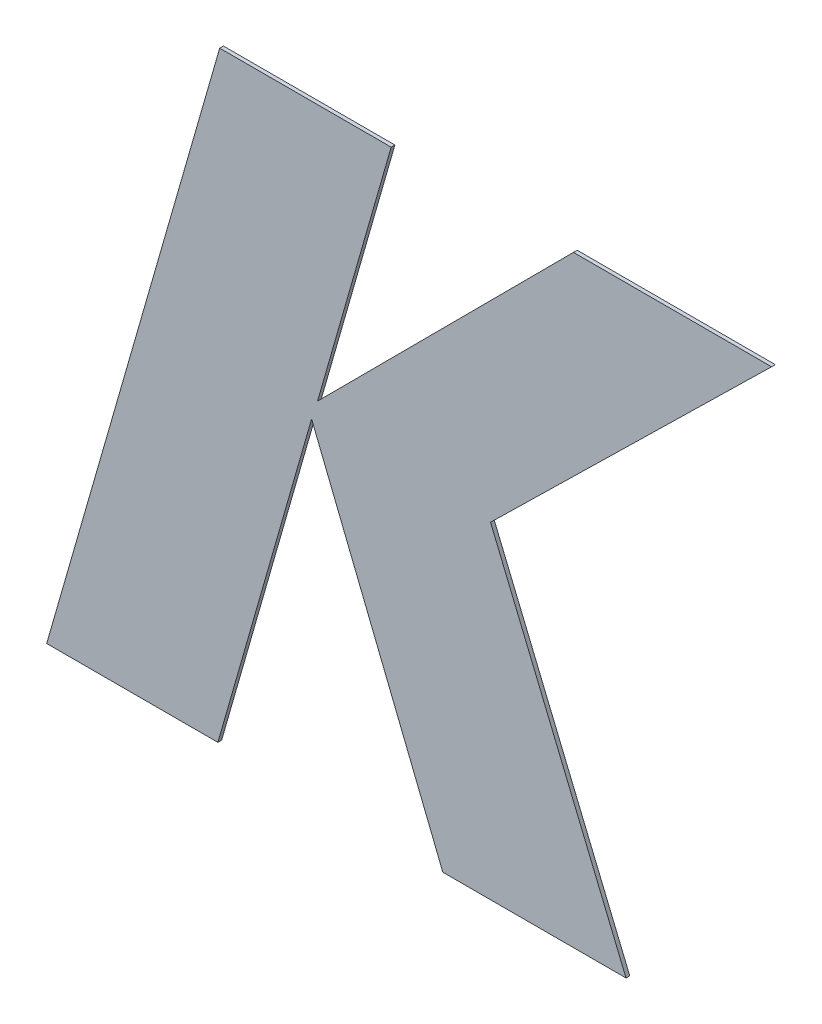
ISO-10303-21;
HEADER;
FILE_DESCRIPTION(('STEP AP214'),'2;1');
FILE_NAME('part.step','',(''),(''),'','','');
FILE_SCHEMA(('AUTOMOTIVE_DESIGN { 1 0 10303 214 1 1 1 1 }'));
ENDSEC;
DATA;
#1=APPLICATION_CONTEXT('core data for automotive mechanical design processes');
#2=APPLICATION_PROTOCOL_DEFINITION('international standard','automotive_design',2000,#1);
#3=PRODUCT_CONTEXT('',#1,'mechanical');
#4=PRODUCT('Part','Part','',(#3));
#5=PRODUCT_RELATED_PRODUCT_CATEGORY('part','',(#4));
#6=PRODUCT_DEFINITION_FORMATION('','',#4);
#7=PRODUCT_DEFINITION_CONTEXT('part definition',#1,'design');
#8=PRODUCT_DEFINITION('design','',#6,#7);
#9=PRODUCT_DEFINITION_SHAPE('','',#8);
#10=(LENGTH_UNIT() NAMED_UNIT(*) SI_UNIT(.MILLI.,.METRE.));
#11=(NAMED_UNIT(*) PLANE_ANGLE_UNIT() SI_UNIT($,.RADIAN.));
#12=(NAMED_UNIT(*) SI_UNIT($,.STERADIAN.) SOLID_ANGLE_UNIT());
#13=UNCERTAINTY_MEASURE_WITH_UNIT(LENGTH_MEASURE(1.E-05),#10,'distance_accuracy_value','');
#14=(GEOMETRIC_REPRESENTATION_CONTEXT(3) GLOBAL_UNCERTAINTY_ASSIGNED_CONTEXT((#13)) GLOBAL_UNIT_ASSIGNED_CONTEXT((#10,
#11,#12)) REPRESENTATION_CONTEXT('',''));
#15=CARTESIAN_POINT('',(0.,0.,0.));
#16=DIRECTION('',(0.,0.,1.));
#17=DIRECTION('',(1.,0.,0.));
#18=AXIS2_PLACEMENT_3D('',#15,#16,#17);
#19=CARTESIAN_POINT('',(1.54152,2.79695,2.505));
#20=DIRECTION('',(0.961099233431586,-0.276203301025201,0.));
#21=DIRECTION('',(0.,0.,-1.));
#22=AXIS2_PLACEMENT_3D('',#19,#20,#21);
#23=PLANE('',#22);
#24=DIRECTION('',(-0.276203301025201,-0.961099233431586,0.));
#25=VECTOR('',#24,1.);
#26=CARTESIAN_POINT('',(1.54152,2.79695,2.5));
#27=LINE('',#26,#25);
#28=CARTESIAN_POINT('',(1.77328279920816,3.60341048700408,2.5));
#29=VERTEX_POINT('',#28);
#30=CARTESIAN_POINT('',(1.54152,2.79695,2.5));
#31=VERTEX_POINT('',#30);
#32=EDGE_CURVE('E10',#29,#31,#27,.T.);
#33=ORIENTED_EDGE('',*,*,#32,.T.);
#34=DIRECTION('',(0.,0.,-1.));
#35=VECTOR('',#34,1.);
#36=CARTESIAN_POINT('',(1.54152,2.79695,2.505));
#37=LINE('',#36,#35);
#38=CARTESIAN_POINT('',(1.54152,2.79695,2.505));
#39=VERTEX_POINT('',#38);
#40=EDGE_CURVE('E42',#39,#31,#37,.T.);
#41=ORIENTED_EDGE('',*,*,#40,.F.);
#42=DIRECTION('',(-0.276203301025201,-0.961099233431586,0.));
#43=VECTOR('',#42,1.);
#44=CARTESIAN_POINT('',(1.54152,2.79695,2.505));
#45=LINE('',#44,#43);
#46=CARTESIAN_POINT('',(1.77328279920816,3.60341048700408,2.505));
#47=VERTEX_POINT('',#46);
#48=EDGE_CURVE('E131',#47,#39,#45,.T.);
#49=ORIENTED_EDGE('',*,*,#48,.F.);
#50=DIRECTION('',(0.,0.,-1.));
#51=VECTOR('',#50,1.);
#52=CARTESIAN_POINT('',(1.77328279920816,3.60341048700408,2.505));
#53=LINE('',#52,#51);
#54=EDGE_CURVE('E27',#47,#29,#53,.T.);
#55=ORIENTED_EDGE('',*,*,#54,.T.);
#56=EDGE_LOOP('',(#33,#41,#49,#55));
#57=FACE_BOUND('',#56,.T.);
#58=ADVANCED_FACE('F16',(#57),#23,.F.);
#59=CARTESIAN_POINT('',(1.77084047990213,2.79695,2.505));
#60=DIRECTION('',(0.,1.,0.));
#61=DIRECTION('',(1.,0.,-1.10443527591038E-13));
#62=AXIS2_PLACEMENT_3D('',#59,#60,#61);
#63=PLANE('',#62);
#64=DIRECTION('',(1.,-1.10443527591038E-13,0.));
#65=VECTOR('',#64,1.);
#66=CARTESIAN_POINT('',(1.77084047990213,2.79695,2.5));
#67=LINE('',#66,#65);
#68=CARTESIAN_POINT('',(1.77084047990213,2.79695,2.5));
#69=VERTEX_POINT('',#68);
#70=EDGE_CURVE('E137',#31,#69,#67,.T.);
#71=ORIENTED_EDGE('',*,*,#70,.T.);
#72=DIRECTION('',(0.,0.,-1.));
#73=VECTOR('',#72,1.);
#74=CARTESIAN_POINT('',(1.77084047990213,2.79695,2.505));
#75=LINE('',#74,#73);
#76=CARTESIAN_POINT('',(1.77084047990213,2.79695,2.505));
#77=VERTEX_POINT('',#76);
#78=EDGE_CURVE('E134',#77,#69,#75,.T.);
#79=ORIENTED_EDGE('',*,*,#78,.F.);
#80=DIRECTION('',(1.,-1.10443527591038E-13,0.));
#81=VECTOR('',#80,1.);
#82=CARTESIAN_POINT('',(1.77084047990213,2.79695,2.505));
#83=LINE('',#82,#81);
#84=EDGE_CURVE('E125',#39,#77,#83,.T.);
#85=ORIENTED_EDGE('',*,*,#84,.F.);
#86=ORIENTED_EDGE('',*,*,#40,.T.);
#87=EDGE_LOOP('',(#71,#79,#85,#86));
#88=FACE_BOUND('',#87,.T.);
#89=ADVANCED_FACE('F135',(#88),#63,.F.);
#90=CARTESIAN_POINT('',(1.89634770470114,3.23483615675617,2.505));
#91=DIRECTION('',(-0.961293454474758,0.275526576547503,0.));
#92=DIRECTION('',(0.,0.,1.));
#93=AXIS2_PLACEMENT_3D('',#90,#91,#92);
#94=PLANE('',#93);
#95=DIRECTION('',(0.275526576547503,0.961293454474758,0.));
#96=VECTOR('',#95,1.);
#97=CARTESIAN_POINT('',(1.89634770470114,3.23483615675617,2.5));
#98=LINE('',#97,#96);
#99=CARTESIAN_POINT('',(1.89634770470114,3.23483615675617,2.5));
#100=VERTEX_POINT('',#99);
#101=EDGE_CURVE('E142',#69,#100,#98,.T.);
#102=ORIENTED_EDGE('',*,*,#101,.T.);
#103=DIRECTION('',(0.,0.,-1.));
#104=VECTOR('',#103,1.);
#105=CARTESIAN_POINT('',(1.89634770470114,3.23483615675617,2.505));
#106=LINE('',#105,#104);
#107=CARTESIAN_POINT('',(1.89634770470114,3.23483615675617,2.505));
#108=VERTEX_POINT('',#107);
#109=EDGE_CURVE('E146',#108,#100,#106,.T.);
#110=ORIENTED_EDGE('',*,*,#109,.F.);
#111=DIRECTION('',(0.275526576547503,0.961293454474758,0.));
#112=VECTOR('',#111,1.);
#113=CARTESIAN_POINT('',(1.89634770470114,3.23483615675617,2.505));
#114=LINE('',#113,#112);
#115=EDGE_CURVE('E129',#77,#108,#114,.T.);
#116=ORIENTED_EDGE('',*,*,#115,.F.);
#117=ORIENTED_EDGE('',*,*,#78,.T.);
#118=EDGE_LOOP('',(#102,#110,#116,#117));
#119=FACE_BOUND('',#118,.T.);
#120=ADVANCED_FACE('F145',(#119),#94,.F.);
#121=CARTESIAN_POINT('',(2.07211372791904,2.79695,2.505));
#122=DIRECTION('',(0.928029086213704,0.372507738364397,0.));
#123=DIRECTION('',(0.,0.,-1.));
#124=AXIS2_PLACEMENT_3D('',#121,#122,#123);
#125=PLANE('',#124);
#126=DIRECTION('',(0.372507738364397,-0.928029086213704,0.));
#127=VECTOR('',#126,1.);
#128=CARTESIAN_POINT('',(2.07211372791904,2.79695,2.5));
#129=LINE('',#128,#127);
#130=CARTESIAN_POINT('',(2.07211372791904,2.79695,2.5));
#131=VERTEX_POINT('',#130);
#132=EDGE_CURVE('E143',#100,#131,#129,.T.);
#133=ORIENTED_EDGE('',*,*,#132,.T.);
#134=DIRECTION('',(0.,0.,-1.));
#135=VECTOR('',#134,1.);
#136=CARTESIAN_POINT('',(2.07211372791904,2.79695,2.505));
#137=LINE('',#136,#135);
#138=CARTESIAN_POINT('',(2.07211372791904,2.79695,2.505));
#139=VERTEX_POINT('',#138);
#140=EDGE_CURVE('E165',#139,#131,#137,.T.);
#141=ORIENTED_EDGE('',*,*,#140,.F.);
#142=DIRECTION('',(0.372507738364397,-0.928029086213704,0.));
#143=VECTOR('',#142,1.);
#144=CARTESIAN_POINT('',(2.07211372791904,2.79695,2.505));
#145=LINE('',#144,#143);
#146=EDGE_CURVE('E149',#108,#139,#145,.T.);
#147=ORIENTED_EDGE('',*,*,#146,.F.);
#148=ORIENTED_EDGE('',*,*,#109,.T.);
#149=EDGE_LOOP('',(#133,#141,#147,#148));
#150=FACE_BOUND('',#149,.T.);
#151=ADVANCED_FACE('F308',(#150),#125,.F.);
#152=CARTESIAN_POINT('',(2.31749318928673,2.79695,2.505));
#153=DIRECTION('',(0.,1.,0.));
#154=DIRECTION('',(1.,0.,0.));
#155=AXIS2_PLACEMENT_3D('',#152,#153,#154);
#156=PLANE('',#155);
#157=DIRECTION('',(1.,0.,0.));
#158=VECTOR('',#157,1.);
#159=CARTESIAN_POINT('',(2.31749318928673,2.79695,2.5));
#160=LINE('',#159,#158);
#161=CARTESIAN_POINT('',(2.31749318928673,2.79695,2.5));
#162=VERTEX_POINT('',#161);
#163=EDGE_CURVE('E210',#131,#162,#160,.T.);
#164=ORIENTED_EDGE('',*,*,#163,.T.);
#165=DIRECTION('',(0.,0.,-1.));
#166=VECTOR('',#165,1.);
#167=CARTESIAN_POINT('',(2.31749318928673,2.79695,2.505));
#168=LINE('',#167,#166);
#169=CARTESIAN_POINT('',(2.31749318928673,2.79695,2.505));
#170=VERTEX_POINT('',#169);
#171=EDGE_CURVE('E166',#170,#162,#168,.T.);
#172=ORIENTED_EDGE('',*,*,#171,.F.);
#173=DIRECTION('',(1.,0.,0.));
#174=VECTOR('',#173,1.);
#175=CARTESIAN_POINT('',(2.31749318928673,2.79695,2.505));
#176=LINE('',#175,#174);
#177=EDGE_CURVE('E155',#139,#170,#176,.T.);
#178=ORIENTED_EDGE('',*,*,#177,.F.);
#179=ORIENTED_EDGE('',*,*,#140,.T.);
#180=EDGE_LOOP('',(#164,#172,#178,#179));
#181=FACE_BOUND('',#180,.T.);
#182=ADVANCED_FACE('F346',(#181),#156,.F.);
#183=CARTESIAN_POINT('',(2.1359867363703,3.23483615675617,2.505));
#184=DIRECTION('',(-0.923783981403877,-0.382914031737676,0.));
#185=DIRECTION('',(-0.382914031737676,0.923783981403877,0.));
#186=AXIS2_PLACEMENT_3D('',#183,#184,#185);
#187=PLANE('',#186);
#188=DIRECTION('',(-0.382914031737676,0.923783981403877,0.));
#189=VECTOR('',#188,1.);
#190=CARTESIAN_POINT('',(2.1359867363703,3.23483615675617,2.5));
#191=LINE('',#190,#189);
#192=CARTESIAN_POINT('',(2.1359867363703,3.23483615675617,2.5));
#193=VERTEX_POINT('',#192);
#194=EDGE_CURVE('E161',#162,#193,#191,.T.);
#195=ORIENTED_EDGE('',*,*,#194,.T.);
#196=DIRECTION('',(0.,0.,-1.));
#197=VECTOR('',#196,1.);
#198=CARTESIAN_POINT('',(2.1359867363703,3.23483615675617,2.505));
#199=LINE('',#198,#197);
#200=CARTESIAN_POINT('',(2.1359867363703,3.23483615675617,2.505));
#201=VERTEX_POINT('',#200);
#202=EDGE_CURVE('E197',#201,#193,#199,.T.);
#203=ORIENTED_EDGE('',*,*,#202,.F.);
#204=DIRECTION('',(-0.382914031737676,0.923783981403877,0.));
#205=VECTOR('',#204,1.);
#206=CARTESIAN_POINT('',(2.1359867363703,3.23483615675617,2.505));
#207=LINE('',#206,#205);
#208=EDGE_CURVE('E158',#170,#201,#207,.T.);
#209=ORIENTED_EDGE('',*,*,#208,.F.);
#210=ORIENTED_EDGE('',*,*,#171,.T.);
#211=EDGE_LOOP('',(#195,#203,#209,#210));
#212=FACE_BOUND('',#211,.T.);
#213=ADVANCED_FACE('F246',(#212),#187,.F.);
#214=CARTESIAN_POINT('',(2.51246672525286,3.60341048700408,2.505));
#215=DIRECTION('',(-0.699564397226959,0.714569558638263,0.));
#216=DIRECTION('',(0.,0.,1.));
#217=AXIS2_PLACEMENT_3D('',#214,#215,#216);
#218=PLANE('',#217);
#219=DIRECTION('',(0.714569558638262,0.699564397226959,0.));
#220=VECTOR('',#219,1.);
#221=CARTESIAN_POINT('',(2.51246672525286,3.60341048700408,2.5));
#222=LINE('',#221,#220);
#223=CARTESIAN_POINT('',(2.51246672525286,3.60341048700408,2.5));
#224=VERTEX_POINT('',#223);
#225=EDGE_CURVE('E201',#193,#224,#222,.T.);
#226=ORIENTED_EDGE('',*,*,#225,.T.);
#227=DIRECTION('',(0.,0.,-1.));
#228=VECTOR('',#227,1.);
#229=CARTESIAN_POINT('',(2.51246672525286,3.60341048700408,2.505));
#230=LINE('',#229,#228);
#231=CARTESIAN_POINT('',(2.51246672525286,3.60341048700408,2.505));
#232=VERTEX_POINT('',#231);
#233=EDGE_CURVE('E198',#232,#224,#230,.T.);
#234=ORIENTED_EDGE('',*,*,#233,.F.);
#235=DIRECTION('',(0.714569558638262,0.699564397226959,0.));
#236=VECTOR('',#235,1.);
#237=CARTESIAN_POINT('',(2.51246672525286,3.60341048700408,2.505));
#238=LINE('',#237,#236);
#239=EDGE_CURVE('E182',#201,#232,#238,.T.);
#240=ORIENTED_EDGE('',*,*,#239,.F.);
#241=ORIENTED_EDGE('',*,*,#202,.T.);
#242=EDGE_LOOP('',(#226,#234,#240,#241));
#243=FACE_BOUND('',#242,.T.);
#244=ADVANCED_FACE('F18',(#243),#218,.F.);
#245=CARTESIAN_POINT('',(2.24706809769219,3.60341048700408,2.505));
#246=DIRECTION('',(0.,-1.,0.));
#247=DIRECTION('',(0.,0.,-1.));
#248=AXIS2_PLACEMENT_3D('',#245,#246,#247);
#249=PLANE('',#248);
#250=DIRECTION('',(-1.,0.,0.));
#251=VECTOR('',#250,1.);
#252=CARTESIAN_POINT('',(2.24706809769219,3.60341048700408,2.5));
#253=LINE('',#252,#251);
#254=CARTESIAN_POINT('',(2.24706809769219,3.60341048700408,2.5));
#255=VERTEX_POINT('',#254);
#256=EDGE_CURVE('E193',#224,#255,#253,.T.);
#257=ORIENTED_EDGE('',*,*,#256,.T.);
#258=DIRECTION('',(0.,0.,-1.));
#259=VECTOR('',#258,1.);
#260=CARTESIAN_POINT('',(2.24706809769219,3.60341048700408,2.505));
#261=LINE('',#260,#259);
#262=CARTESIAN_POINT('',(2.24706809769219,3.60341048700408,2.505));
#263=VERTEX_POINT('',#262);
#264=EDGE_CURVE('E180',#263,#255,#261,.T.);
#265=ORIENTED_EDGE('',*,*,#264,.F.);
#266=DIRECTION('',(-1.,0.,0.));
#267=VECTOR('',#266,1.);
#268=CARTESIAN_POINT('',(2.24706809769219,3.60341048700408,2.505));
#269=LINE('',#268,#267);
#270=EDGE_CURVE('E20',#232,#263,#269,.T.);
#271=ORIENTED_EDGE('',*,*,#270,.F.);
#272=ORIENTED_EDGE('',*,*,#233,.T.);
#273=EDGE_LOOP('',(#257,#265,#271,#272));
#274=FACE_BOUND('',#273,.T.);
#275=ADVANCED_FACE('F257',(#274),#249,.F.);
#276=CARTESIAN_POINT('',(1.90432937927588,3.25950455606161,2.505));
#277=DIRECTION('',(0.708307753494397,-0.70590376563645,0.));
#278=DIRECTION('',(0.,0.,-1.));
#279=AXIS2_PLACEMENT_3D('',#276,#277,#278);
#280=PLANE('',#279);
#281=DIRECTION('',(-0.70590376563645,-0.708307753494397,0.));
#282=VECTOR('',#281,1.);
#283=CARTESIAN_POINT('',(1.90432937927588,3.25950455606161,2.5));
#284=LINE('',#283,#282);
#285=CARTESIAN_POINT('',(1.90432937927588,3.25950455606161,2.5));
#286=VERTEX_POINT('',#285);
#287=EDGE_CURVE('E205',#255,#286,#284,.T.);
#288=ORIENTED_EDGE('',*,*,#287,.T.);
#289=DIRECTION('',(0.,0.,-1.));
#290=VECTOR('',#289,1.);
#291=CARTESIAN_POINT('',(1.90432937927588,3.25950455606161,2.505));
#292=LINE('',#291,#290);
#293=CARTESIAN_POINT('',(1.90432937927588,3.25950455606161,2.505));
#294=VERTEX_POINT('',#293);
#295=EDGE_CURVE('E181',#294,#286,#292,.T.);
#296=ORIENTED_EDGE('',*,*,#295,.F.);
#297=DIRECTION('',(-0.70590376563645,-0.708307753494397,0.));
#298=VECTOR('',#297,1.);
#299=CARTESIAN_POINT('',(1.90432937927588,3.25950455606161,2.505));
#300=LINE('',#299,#298);
#301=EDGE_CURVE('E221',#263,#294,#300,.T.);
#302=ORIENTED_EDGE('',*,*,#301,.F.);
#303=ORIENTED_EDGE('',*,*,#264,.T.);
#304=EDGE_LOOP('',(#288,#296,#302,#303));
#305=FACE_BOUND('',#304,.T.);
#306=ADVANCED_FACE('F320',(#305),#280,.F.);
#307=CARTESIAN_POINT('',(2.00290979565373,3.60341048700408,2.505));
#308=DIRECTION('',(-0.961286149092731,0.27555206325206,0.));
#309=DIRECTION('',(0.,0.,1.));
#310=AXIS2_PLACEMENT_3D('',#307,#308,#309);
#311=PLANE('',#310);
#312=DIRECTION('',(0.27555206325206,0.961286149092731,0.));
#313=VECTOR('',#312,1.);
#314=CARTESIAN_POINT('',(2.00290979565373,3.60341048700408,2.5));
#315=LINE('',#314,#313);
#316=CARTESIAN_POINT('',(2.00290979565373,3.60341048700408,2.5));
#317=VERTEX_POINT('',#316);
#318=EDGE_CURVE('E177',#286,#317,#315,.T.);
#319=ORIENTED_EDGE('',*,*,#318,.T.);
#320=DIRECTION('',(0.,0.,-1.));
#321=VECTOR('',#320,1.);
#322=CARTESIAN_POINT('',(2.00290979565373,3.60341048700408,2.505));
#323=LINE('',#322,#321);
#324=CARTESIAN_POINT('',(2.00290979565373,3.60341048700408,2.505));
#325=VERTEX_POINT('',#324);
#326=EDGE_CURVE('E98',#325,#317,#323,.T.);
#327=ORIENTED_EDGE('',*,*,#326,.F.);
#328=DIRECTION('',(0.27555206325206,0.961286149092731,0.));
#329=VECTOR('',#328,1.);
#330=CARTESIAN_POINT('',(2.00290979565373,3.60341048700408,2.505));
#331=LINE('',#330,#329);
#332=EDGE_CURVE('E112',#294,#325,#331,.T.);
#333=ORIENTED_EDGE('',*,*,#332,.F.);
#334=ORIENTED_EDGE('',*,*,#295,.T.);
#335=EDGE_LOOP('',(#319,#327,#333,#334));
#336=FACE_BOUND('',#335,.T.);
#337=ADVANCED_FACE('F334',(#336),#311,.F.);
#338=CARTESIAN_POINT('',(1.77328279920816,3.60341048700408,2.505));
#339=DIRECTION('',(0.,-1.,0.));
#340=DIRECTION('',(0.,0.,-1.));
#341=AXIS2_PLACEMENT_3D('',#338,#339,#340);
#342=PLANE('',#341);
#343=DIRECTION('',(-1.,0.,0.));
#344=VECTOR('',#343,1.);
#345=CARTESIAN_POINT('',(1.77328279920816,3.60341048700408,2.5));
#346=LINE('',#345,#344);
#347=EDGE_CURVE('E188',#317,#29,#346,.T.);
#348=ORIENTED_EDGE('',*,*,#347,.T.);
#349=ORIENTED_EDGE('',*,*,#54,.F.);
#350=DIRECTION('',(-1.,0.,0.));
#351=VECTOR('',#350,1.);
#352=CARTESIAN_POINT('',(1.77328279920816,3.60341048700408,2.505));
#353=LINE('',#352,#351);
#354=EDGE_CURVE('E174',#325,#47,#353,.T.);
#355=ORIENTED_EDGE('',*,*,#354,.F.);
#356=ORIENTED_EDGE('',*,*,#326,.T.);
#357=EDGE_LOOP('',(#348,#349,#355,#356));
#358=FACE_BOUND('',#357,.T.);
#359=ADVANCED_FACE('F329',(#358),#342,.F.);
#360=CARTESIAN_POINT('',(-0.0875343276926901,0.18669957358834,2.505));
#361=DIRECTION('',(0.,0.,-1.));
#362=DIRECTION('',(0.,-1.,0.));
#363=AXIS2_PLACEMENT_3D('',#360,#361,#362);
#364=PLANE('',#363);
#365=ORIENTED_EDGE('',*,*,#48,.T.);
#366=ORIENTED_EDGE('',*,*,#84,.T.);
#367=ORIENTED_EDGE('',*,*,#115,.T.);
#368=ORIENTED_EDGE('',*,*,#146,.T.);
#369=ORIENTED_EDGE('',*,*,#177,.T.);
#370=ORIENTED_EDGE('',*,*,#208,.T.);
#371=ORIENTED_EDGE('',*,*,#239,.T.);
#372=ORIENTED_EDGE('',*,*,#270,.T.);
#373=ORIENTED_EDGE('',*,*,#301,.T.);
#374=ORIENTED_EDGE('',*,*,#332,.T.);
#375=ORIENTED_EDGE('',*,*,#354,.T.);
#376=EDGE_LOOP('',(#365,#366,#367,#368,#369,#370,#371,#372,#373,#374,#375));
#377=FACE_BOUND('',#376,.T.);
#378=ADVANCED_FACE('F127',(#377),#364,.F.);
#379=CARTESIAN_POINT('',(-0.0875343276926901,0.18669957358834,2.5));
#380=DIRECTION('',(0.,0.,-1.));
#381=DIRECTION('',(0.,-1.,0.));
#382=AXIS2_PLACEMENT_3D('',#379,#380,#381);
#383=PLANE('',#382);
#384=ORIENTED_EDGE('',*,*,#32,.F.);
#385=ORIENTED_EDGE('',*,*,#347,.F.);
#386=ORIENTED_EDGE('',*,*,#318,.F.);
#387=ORIENTED_EDGE('',*,*,#287,.F.);
#388=ORIENTED_EDGE('',*,*,#256,.F.);
#389=ORIENTED_EDGE('',*,*,#225,.F.);
#390=ORIENTED_EDGE('',*,*,#194,.F.);
#391=ORIENTED_EDGE('',*,*,#163,.F.);
#392=ORIENTED_EDGE('',*,*,#132,.F.);
#393=ORIENTED_EDGE('',*,*,#101,.F.);
#394=ORIENTED_EDGE('',*,*,#70,.F.);
#395=EDGE_LOOP('',(#384,#385,#386,#387,#388,#389,#390,#391,#392,#393,#394));
#396=FACE_BOUND('',#395,.T.);
#397=ADVANCED_FACE('F251',(#396),#383,.T.);
#398=CLOSED_SHELL('',(#58,#89,#120,#151,#182,#213,#244,#275,#306,#337,#359,#378,#397));
#399=MANIFOLD_SOLID_BREP('B1',#398);
#400=ADVANCED_BREP_SHAPE_REPRESENTATION('',(#18,#399),#14);
#401=SHAPE_DEFINITION_REPRESENTATION(#9,#400);
ENDSEC;
END-ISO-10303-21;
